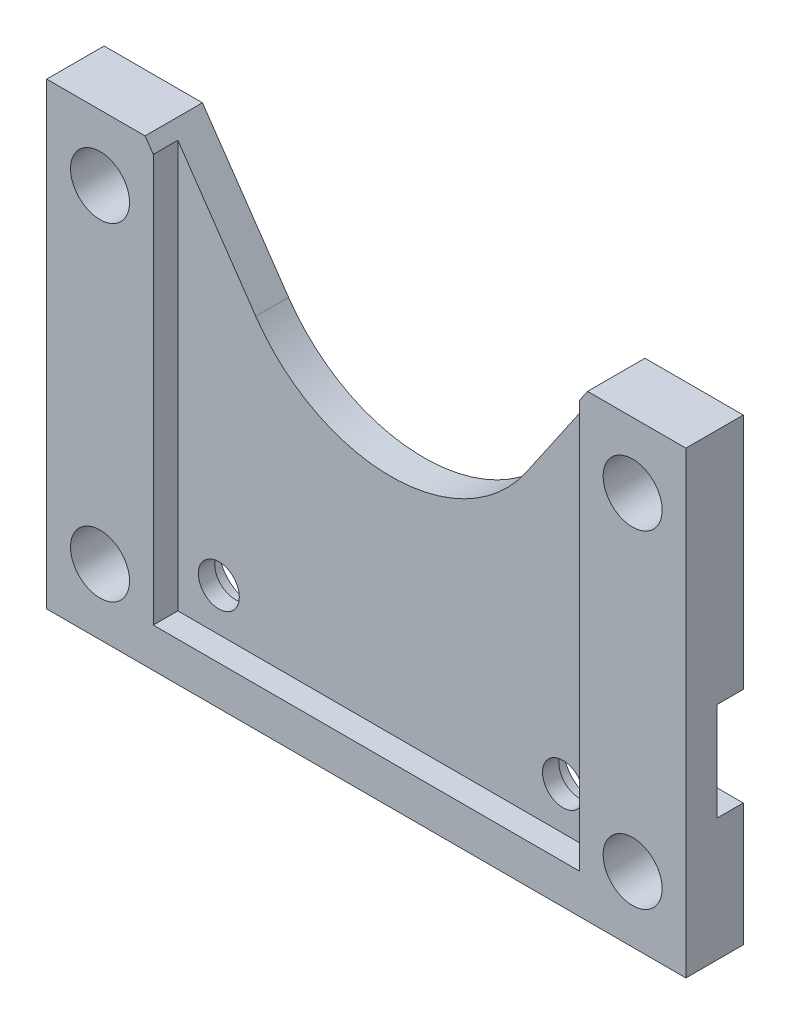
ISO-10303-21;
HEADER;
FILE_DESCRIPTION(('STEP AP214'),'2;1');
FILE_NAME('part.step','',(''),(''),'','','');
FILE_SCHEMA(('AUTOMOTIVE_DESIGN { 1 0 10303 214 1 1 1 1 }'));
ENDSEC;
DATA;
#1=APPLICATION_CONTEXT('core data for automotive mechanical design processes');
#2=APPLICATION_PROTOCOL_DEFINITION('international standard','automotive_design',2000,#1);
#3=PRODUCT_CONTEXT('',#1,'mechanical');
#4=PRODUCT('Part','Part','',(#3));
#5=PRODUCT_RELATED_PRODUCT_CATEGORY('part','',(#4));
#6=PRODUCT_DEFINITION_FORMATION('','',#4);
#7=PRODUCT_DEFINITION_CONTEXT('part definition',#1,'design');
#8=PRODUCT_DEFINITION('design','',#6,#7);
#9=PRODUCT_DEFINITION_SHAPE('','',#8);
#10=(LENGTH_UNIT() NAMED_UNIT(*) SI_UNIT(.MILLI.,.METRE.));
#11=(NAMED_UNIT(*) PLANE_ANGLE_UNIT() SI_UNIT($,.RADIAN.));
#12=(NAMED_UNIT(*) SI_UNIT($,.STERADIAN.) SOLID_ANGLE_UNIT());
#13=UNCERTAINTY_MEASURE_WITH_UNIT(LENGTH_MEASURE(1.E-05),#10,'distance_accuracy_value','');
#14=(GEOMETRIC_REPRESENTATION_CONTEXT(3) GLOBAL_UNCERTAINTY_ASSIGNED_CONTEXT((#13)) GLOBAL_UNIT_ASSIGNED_CONTEXT((#10,
#11,#12)) REPRESENTATION_CONTEXT('',''));
#15=CARTESIAN_POINT('',(0.,0.,0.));
#16=DIRECTION('',(0.,0.,1.));
#17=DIRECTION('',(1.,0.,0.));
#18=AXIS2_PLACEMENT_3D('',#15,#16,#17);
#19=CARTESIAN_POINT('',(0.,21.,0.));
#20=DIRECTION('',(0.,0.,1.));
#21=DIRECTION('',(1.,0.,0.));
#22=AXIS2_PLACEMENT_3D('',#19,#20,#21);
#23=PLANE('',#22);
#24=CARTESIAN_POINT('',(16.25,19.,0.));
#25=DIRECTION('',(0.,0.,1.));
#26=DIRECTION('',(-1.,0.,0.));
#27=AXIS2_PLACEMENT_3D('',#24,#25,#26);
#28=CIRCLE('',#27,1.8);
#29=CARTESIAN_POINT('',(14.45,19.,0.));
#30=VERTEX_POINT('',#29);
#31=EDGE_CURVE('E293',#30,#30,#28,.T.);
#32=ORIENTED_EDGE('',*,*,#31,.T.);
#33=EDGE_LOOP('',(#32));
#34=FACE_BOUND('',#33,.T.);
#35=CARTESIAN_POINT('',(-16.25,19.,0.));
#36=DIRECTION('',(0.,0.,1.));
#37=DIRECTION('',(1.,0.,0.));
#38=AXIS2_PLACEMENT_3D('',#35,#36,#37);
#39=CIRCLE('',#38,1.8);
#40=CARTESIAN_POINT('',(-14.45,19.,0.));
#41=VERTEX_POINT('',#40);
#42=EDGE_CURVE('E302',#41,#41,#39,.T.);
#43=ORIENTED_EDGE('',*,*,#42,.T.);
#44=EDGE_LOOP('',(#43));
#45=FACE_BOUND('',#44,.T.);
#46=DIRECTION('',(0.,1.,0.));
#47=VECTOR('',#46,1.);
#48=CARTESIAN_POINT('',(19.5,-5.,0.));
#49=LINE('',#48,#47);
#50=CARTESIAN_POINT('',(19.5,8.5,0.));
#51=VERTEX_POINT('',#50);
#52=CARTESIAN_POINT('',(19.5,23.,0.));
#53=VERTEX_POINT('',#52);
#54=EDGE_CURVE('E180',#51,#53,#49,.T.);
#55=ORIENTED_EDGE('',*,*,#54,.F.);
#56=DIRECTION('',(-1.,0.,0.));
#57=VECTOR('',#56,1.);
#58=CARTESIAN_POINT('',(19.5,8.5,0.));
#59=LINE('',#58,#57);
#60=CARTESIAN_POINT('',(-19.5,8.5,0.));
#61=VERTEX_POINT('',#60);
#62=EDGE_CURVE('E237',#51,#61,#59,.T.);
#63=ORIENTED_EDGE('',*,*,#62,.T.);
#64=DIRECTION('',(0.,-1.,0.));
#65=VECTOR('',#64,1.);
#66=CARTESIAN_POINT('',(-19.5,-5.,0.));
#67=LINE('',#66,#65);
#68=CARTESIAN_POINT('',(-19.5,23.,0.));
#69=VERTEX_POINT('',#68);
#70=EDGE_CURVE('E314',#69,#61,#67,.T.);
#71=ORIENTED_EDGE('',*,*,#70,.F.);
#72=DIRECTION('',(-1.,0.,0.));
#73=VECTOR('',#72,1.);
#74=CARTESIAN_POINT('',(-19.5,23.,0.));
#75=LINE('',#74,#73);
#76=CARTESIAN_POINT('',(-13.5,23.,0.));
#77=VERTEX_POINT('',#76);
#78=EDGE_CURVE('E193',#77,#69,#75,.T.);
#79=ORIENTED_EDGE('',*,*,#78,.F.);
#80=DIRECTION('',(-0.565775492304941,0.824559332193324,0.));
#81=VECTOR('',#80,1.);
#82=CARTESIAN_POINT('',(-13.5,23.,0.));
#83=LINE('',#82,#81);
#84=CARTESIAN_POINT('',(-8.24559332193325,15.3422450769506,0.));
#85=VERTEX_POINT('',#84);
#86=EDGE_CURVE('E191',#85,#77,#83,.T.);
#87=ORIENTED_EDGE('',*,*,#86,.F.);
#88=CARTESIAN_POINT('',(0.,21.,0.));
#89=DIRECTION('',(0.,0.,-1.));
#90=DIRECTION('',(1.,0.,0.));
#91=AXIS2_PLACEMENT_3D('',#88,#89,#90);
#92=CIRCLE('',#91,9.99999999999999);
#93=CARTESIAN_POINT('',(8.24559332193324,15.3422450769506,0.));
#94=VERTEX_POINT('',#93);
#95=EDGE_CURVE('E189',#94,#85,#92,.T.);
#96=ORIENTED_EDGE('',*,*,#95,.F.);
#97=DIRECTION('',(-0.565775492304941,-0.824559332193324,0.));
#98=VECTOR('',#97,1.);
#99=CARTESIAN_POINT('',(13.5,23.,0.));
#100=LINE('',#99,#98);
#101=CARTESIAN_POINT('',(13.5,23.,0.));
#102=VERTEX_POINT('',#101);
#103=EDGE_CURVE('E182',#102,#94,#100,.T.);
#104=ORIENTED_EDGE('',*,*,#103,.F.);
#105=DIRECTION('',(-1.,0.,0.));
#106=VECTOR('',#105,1.);
#107=CARTESIAN_POINT('',(19.5,23.,0.));
#108=LINE('',#107,#106);
#109=EDGE_CURVE('E179',#53,#102,#108,.T.);
#110=ORIENTED_EDGE('',*,*,#109,.F.);
#111=EDGE_LOOP('',(#55,#63,#71,#79,#87,#96,#104,#110));
#112=FACE_BOUND('',#111,.T.);
#113=ADVANCED_FACE('F41',(#34,#45,#112),#23,.F.);
#114=CARTESIAN_POINT('',(-10.5,0.,2.));
#115=DIRECTION('',(0.,0.,-1.));
#116=DIRECTION('',(-1.,0.,0.));
#117=AXIS2_PLACEMENT_3D('',#114,#115,#116);
#118=CYLINDRICAL_SURFACE('',#117,1.25);
#119=CARTESIAN_POINT('',(-10.5,0.,2.));
#120=DIRECTION('',(0.,0.,1.));
#121=DIRECTION('',(1.,0.,0.));
#122=AXIS2_PLACEMENT_3D('',#119,#120,#121);
#123=CIRCLE('',#122,1.25);
#124=CARTESIAN_POINT('',(-9.25,0.,2.));
#125=VERTEX_POINT('',#124);
#126=EDGE_CURVE('E308',#125,#125,#123,.T.);
#127=ORIENTED_EDGE('',*,*,#126,.T.);
#128=EDGE_LOOP('',(#127));
#129=FACE_BOUND('',#128,.T.);
#130=CARTESIAN_POINT('',(-10.5,0.,1.));
#131=DIRECTION('',(0.,0.,-1.));
#132=DIRECTION('',(-1.,0.,0.));
#133=AXIS2_PLACEMENT_3D('',#130,#131,#132);
#134=CIRCLE('',#133,1.25);
#135=CARTESIAN_POINT('',(-11.75,0.,1.));
#136=VERTEX_POINT('',#135);
#137=EDGE_CURVE('E45',#136,#136,#134,.T.);
#138=ORIENTED_EDGE('',*,*,#137,.T.);
#139=EDGE_LOOP('',(#138));
#140=FACE_BOUND('',#139,.T.);
#141=ADVANCED_FACE('F397',(#129,#140),#118,.F.);
#142=CARTESIAN_POINT('',(10.5,0.,2.));
#143=DIRECTION('',(0.,0.,-1.));
#144=DIRECTION('',(-1.,0.,0.));
#145=AXIS2_PLACEMENT_3D('',#142,#143,#144);
#146=CYLINDRICAL_SURFACE('',#145,1.25);
#147=CARTESIAN_POINT('',(10.5,0.,2.));
#148=DIRECTION('',(0.,0.,1.));
#149=DIRECTION('',(1.,0.,0.));
#150=AXIS2_PLACEMENT_3D('',#147,#148,#149);
#151=CIRCLE('',#150,1.25);
#152=CARTESIAN_POINT('',(11.75,0.,2.));
#153=VERTEX_POINT('',#152);
#154=EDGE_CURVE('E305',#153,#153,#151,.T.);
#155=ORIENTED_EDGE('',*,*,#154,.T.);
#156=EDGE_LOOP('',(#155));
#157=FACE_BOUND('',#156,.T.);
#158=CARTESIAN_POINT('',(10.5,0.,1.));
#159=DIRECTION('',(0.,0.,-1.));
#160=DIRECTION('',(-1.,0.,0.));
#161=AXIS2_PLACEMENT_3D('',#158,#159,#160);
#162=CIRCLE('',#161,1.25);
#163=CARTESIAN_POINT('',(9.25,0.,1.));
#164=VERTEX_POINT('',#163);
#165=EDGE_CURVE('E215',#164,#164,#162,.T.);
#166=ORIENTED_EDGE('',*,*,#165,.T.);
#167=EDGE_LOOP('',(#166));
#168=FACE_BOUND('',#167,.T.);
#169=ADVANCED_FACE('F404',(#157,#168),#146,.F.);
#170=CARTESIAN_POINT('',(0.,21.,2.));
#171=DIRECTION('',(0.,0.,1.));
#172=DIRECTION('',(1.,0.,0.));
#173=AXIS2_PLACEMENT_3D('',#170,#171,#172);
#174=PLANE('',#173);
#175=DIRECTION('',(0.,1.,0.));
#176=VECTOR('',#175,1.);
#177=CARTESIAN_POINT('',(-13.,22.2713016528569,2.));
#178=LINE('',#177,#176);
#179=CARTESIAN_POINT('',(-13.,-2.6,2.));
#180=VERTEX_POINT('',#179);
#181=CARTESIAN_POINT('',(-13.,22.2713016528569,2.));
#182=VERTEX_POINT('',#181);
#183=EDGE_CURVE('E66',#180,#182,#178,.T.);
#184=ORIENTED_EDGE('',*,*,#183,.F.);
#185=DIRECTION('',(-1.,0.,0.));
#186=VECTOR('',#185,1.);
#187=CARTESIAN_POINT('',(-13.,-2.6,2.));
#188=LINE('',#187,#186);
#189=CARTESIAN_POINT('',(13.,-2.6,2.));
#190=VERTEX_POINT('',#189);
#191=EDGE_CURVE('E279',#190,#180,#188,.T.);
#192=ORIENTED_EDGE('',*,*,#191,.F.);
#193=DIRECTION('',(0.,-1.,0.));
#194=VECTOR('',#193,1.);
#195=CARTESIAN_POINT('',(13.,22.2713016528569,2.));
#196=LINE('',#195,#194);
#197=CARTESIAN_POINT('',(13.,22.2713016528569,2.));
#198=VERTEX_POINT('',#197);
#199=EDGE_CURVE('E249',#198,#190,#196,.T.);
#200=ORIENTED_EDGE('',*,*,#199,.F.);
#201=DIRECTION('',(-0.565775492304941,-0.824559332193324,0.));
#202=VECTOR('',#201,1.);
#203=CARTESIAN_POINT('',(13.5,23.,2.));
#204=LINE('',#203,#202);
#205=CARTESIAN_POINT('',(8.24559332193324,15.3422450769506,2.));
#206=VERTEX_POINT('',#205);
#207=EDGE_CURVE('E195',#198,#206,#204,.T.);
#208=ORIENTED_EDGE('',*,*,#207,.T.);
#209=CARTESIAN_POINT('',(0.,21.,2.));
#210=DIRECTION('',(0.,0.,-1.));
#211=DIRECTION('',(1.,0.,0.));
#212=AXIS2_PLACEMENT_3D('',#209,#210,#211);
#213=CIRCLE('',#212,9.99999999999999);
#214=CARTESIAN_POINT('',(-8.24559332193325,15.3422450769506,2.));
#215=VERTEX_POINT('',#214);
#216=EDGE_CURVE('E312',#206,#215,#213,.T.);
#217=ORIENTED_EDGE('',*,*,#216,.T.);
#218=DIRECTION('',(-0.565775492304941,0.824559332193324,0.));
#219=VECTOR('',#218,1.);
#220=CARTESIAN_POINT('',(-13.5,23.,2.));
#221=LINE('',#220,#219);
#222=EDGE_CURVE('E200',#215,#182,#221,.T.);
#223=ORIENTED_EDGE('',*,*,#222,.T.);
#224=EDGE_LOOP('',(#184,#192,#200,#208,#217,#223));
#225=FACE_BOUND('',#224,.T.);
#226=ORIENTED_EDGE('',*,*,#126,.F.);
#227=EDGE_LOOP('',(#226));
#228=FACE_BOUND('',#227,.T.);
#229=ORIENTED_EDGE('',*,*,#154,.F.);
#230=EDGE_LOOP('',(#229));
#231=FACE_BOUND('',#230,.T.);
#232=ADVANCED_FACE('F349',(#225,#228,#231),#174,.T.);
#233=CARTESIAN_POINT('',(10.5,0.,0.));
#234=DIRECTION('',(0.,0.,-1.));
#235=DIRECTION('',(-1.,0.,0.));
#236=AXIS2_PLACEMENT_3D('',#233,#234,#235);
#237=CIRCLE('',#236,2.);
#238=CARTESIAN_POINT('',(8.5,0.,0.));
#239=VERTEX_POINT('',#238);
#240=EDGE_CURVE('E223',#239,#239,#237,.T.);
#241=ORIENTED_EDGE('',*,*,#240,.F.);
#242=EDGE_LOOP('',(#241));
#243=FACE_BOUND('',#242,.T.);
#244=CARTESIAN_POINT('',(-10.5,0.,0.));
#245=DIRECTION('',(0.,0.,-1.));
#246=DIRECTION('',(-1.,0.,0.));
#247=AXIS2_PLACEMENT_3D('',#244,#245,#246);
#248=CIRCLE('',#247,2.);
#249=CARTESIAN_POINT('',(-12.5,0.,0.));
#250=VERTEX_POINT('',#249);
#251=EDGE_CURVE('E228',#250,#250,#248,.T.);
#252=ORIENTED_EDGE('',*,*,#251,.F.);
#253=EDGE_LOOP('',(#252));
#254=FACE_BOUND('',#253,.T.);
#255=CARTESIAN_POINT('',(-19.5,2.5,0.));
#256=VERTEX_POINT('',#255);
#257=CARTESIAN_POINT('',(-19.5,-5.,0.));
#258=VERTEX_POINT('',#257);
#259=EDGE_CURVE('E173',#256,#258,#67,.T.);
#260=ORIENTED_EDGE('',*,*,#259,.F.);
#261=DIRECTION('',(-1.,0.,0.));
#262=VECTOR('',#261,1.);
#263=CARTESIAN_POINT('',(19.5,2.5,0.));
#264=LINE('',#263,#262);
#265=CARTESIAN_POINT('',(19.5,2.5,0.));
#266=VERTEX_POINT('',#265);
#267=EDGE_CURVE('E159',#266,#256,#264,.T.);
#268=ORIENTED_EDGE('',*,*,#267,.F.);
#269=CARTESIAN_POINT('',(19.5,-5.,0.));
#270=VERTEX_POINT('',#269);
#271=EDGE_CURVE('E172',#270,#266,#49,.T.);
#272=ORIENTED_EDGE('',*,*,#271,.F.);
#273=DIRECTION('',(1.,0.,0.));
#274=VECTOR('',#273,1.);
#275=CARTESIAN_POINT('',(19.5,-5.,0.));
#276=LINE('',#275,#274);
#277=EDGE_CURVE('E184',#258,#270,#276,.T.);
#278=ORIENTED_EDGE('',*,*,#277,.F.);
#279=EDGE_LOOP('',(#260,#268,#272,#278));
#280=FACE_BOUND('',#279,.T.);
#281=CARTESIAN_POINT('',(-16.25,-1.,0.));
#282=DIRECTION('',(0.,0.,1.));
#283=DIRECTION('',(1.,0.,0.));
#284=AXIS2_PLACEMENT_3D('',#281,#282,#283);
#285=CIRCLE('',#284,1.8);
#286=CARTESIAN_POINT('',(-14.45,-1.,0.));
#287=VERTEX_POINT('',#286);
#288=EDGE_CURVE('E299',#287,#287,#285,.T.);
#289=ORIENTED_EDGE('',*,*,#288,.T.);
#290=EDGE_LOOP('',(#289));
#291=FACE_BOUND('',#290,.T.);
#292=CARTESIAN_POINT('',(16.25,-1.,0.));
#293=DIRECTION('',(0.,0.,1.));
#294=DIRECTION('',(-1.,0.,0.));
#295=AXIS2_PLACEMENT_3D('',#292,#293,#294);
#296=CIRCLE('',#295,1.8);
#297=CARTESIAN_POINT('',(14.45,-1.,0.));
#298=VERTEX_POINT('',#297);
#299=EDGE_CURVE('E296',#298,#298,#296,.T.);
#300=ORIENTED_EDGE('',*,*,#299,.T.);
#301=EDGE_LOOP('',(#300));
#302=FACE_BOUND('',#301,.T.);
#303=ADVANCED_FACE('F169',(#243,#254,#280,#291,#302),#23,.F.);
#304=CARTESIAN_POINT('',(-19.5,-5.,2.));
#305=DIRECTION('',(1.,0.,0.));
#306=DIRECTION('',(0.,0.,-1.));
#307=AXIS2_PLACEMENT_3D('',#304,#305,#306);
#308=PLANE('',#307);
#309=ORIENTED_EDGE('',*,*,#70,.T.);
#310=DIRECTION('',(0.,0.,-1.));
#311=VECTOR('',#310,1.);
#312=CARTESIAN_POINT('',(-19.5,8.5,0.));
#313=LINE('',#312,#311);
#314=CARTESIAN_POINT('',(-19.5,8.5,1.6));
#315=VERTEX_POINT('',#314);
#316=EDGE_CURVE('E164',#315,#61,#313,.T.);
#317=ORIENTED_EDGE('',*,*,#316,.F.);
#318=DIRECTION('',(0.,1.,0.));
#319=VECTOR('',#318,1.);
#320=CARTESIAN_POINT('',(-19.5,8.5,1.6));
#321=LINE('',#320,#319);
#322=CARTESIAN_POINT('',(-19.5,2.5,1.6));
#323=VERTEX_POINT('',#322);
#324=EDGE_CURVE('E379',#323,#315,#321,.T.);
#325=ORIENTED_EDGE('',*,*,#324,.F.);
#326=DIRECTION('',(0.,0.,1.));
#327=VECTOR('',#326,1.);
#328=CARTESIAN_POINT('',(-19.5,2.5,0.));
#329=LINE('',#328,#327);
#330=EDGE_CURVE('E321',#256,#323,#329,.T.);
#331=ORIENTED_EDGE('',*,*,#330,.F.);
#332=ORIENTED_EDGE('',*,*,#259,.T.);
#333=DIRECTION('',(0.,0.,-1.));
#334=VECTOR('',#333,1.);
#335=CARTESIAN_POINT('',(-19.5,-5.,2.));
#336=LINE('',#335,#334);
#337=CARTESIAN_POINT('',(-19.5,-5.,3.5));
#338=VERTEX_POINT('',#337);
#339=EDGE_CURVE('E11',#338,#258,#336,.T.);
#340=ORIENTED_EDGE('',*,*,#339,.F.);
#341=DIRECTION('',(0.,-1.,0.));
#342=VECTOR('',#341,1.);
#343=CARTESIAN_POINT('',(-19.5,-5.,3.5));
#344=LINE('',#343,#342);
#345=CARTESIAN_POINT('',(-19.5,23.,3.5));
#346=VERTEX_POINT('',#345);
#347=EDGE_CURVE('E256',#346,#338,#344,.T.);
#348=ORIENTED_EDGE('',*,*,#347,.F.);
#349=DIRECTION('',(0.,0.,-1.));
#350=VECTOR('',#349,1.);
#351=CARTESIAN_POINT('',(-19.5,23.,2.));
#352=LINE('',#351,#350);
#353=EDGE_CURVE('E196',#346,#69,#352,.T.);
#354=ORIENTED_EDGE('',*,*,#353,.T.);
#355=EDGE_LOOP('',(#309,#317,#325,#331,#332,#340,#348,#354));
#356=FACE_BOUND('',#355,.T.);
#357=ADVANCED_FACE('F43',(#356),#308,.F.);
#358=CARTESIAN_POINT('',(19.5,-5.,2.));
#359=DIRECTION('',(0.,1.,0.));
#360=DIRECTION('',(-1.,0.,0.));
#361=AXIS2_PLACEMENT_3D('',#358,#359,#360);
#362=PLANE('',#361);
#363=ORIENTED_EDGE('',*,*,#277,.T.);
#364=DIRECTION('',(0.,0.,-1.));
#365=VECTOR('',#364,1.);
#366=CARTESIAN_POINT('',(19.5,-5.,2.));
#367=LINE('',#366,#365);
#368=CARTESIAN_POINT('',(19.5,-5.,3.5));
#369=VERTEX_POINT('',#368);
#370=EDGE_CURVE('E50',#369,#270,#367,.T.);
#371=ORIENTED_EDGE('',*,*,#370,.F.);
#372=DIRECTION('',(1.,0.,0.));
#373=VECTOR('',#372,1.);
#374=CARTESIAN_POINT('',(19.5,-5.,3.5));
#375=LINE('',#374,#373);
#376=EDGE_CURVE('E259',#338,#369,#375,.T.);
#377=ORIENTED_EDGE('',*,*,#376,.F.);
#378=ORIENTED_EDGE('',*,*,#339,.T.);
#379=EDGE_LOOP('',(#363,#371,#377,#378));
#380=FACE_BOUND('',#379,.T.);
#381=ADVANCED_FACE('F324',(#380),#362,.F.);
#382=CARTESIAN_POINT('',(19.5,-5.,2.));
#383=DIRECTION('',(-1.,0.,0.));
#384=DIRECTION('',(0.,-1.,0.));
#385=AXIS2_PLACEMENT_3D('',#382,#383,#384);
#386=PLANE('',#385);
#387=DIRECTION('',(0.,1.,0.));
#388=VECTOR('',#387,1.);
#389=CARTESIAN_POINT('',(19.5,8.5,1.6));
#390=LINE('',#389,#388);
#391=CARTESIAN_POINT('',(19.5,2.5,1.6));
#392=VERTEX_POINT('',#391);
#393=CARTESIAN_POINT('',(19.5,8.5,1.6));
#394=VERTEX_POINT('',#393);
#395=EDGE_CURVE('E58',#392,#394,#390,.T.);
#396=ORIENTED_EDGE('',*,*,#395,.T.);
#397=DIRECTION('',(0.,0.,-1.));
#398=VECTOR('',#397,1.);
#399=CARTESIAN_POINT('',(19.5,8.5,0.));
#400=LINE('',#399,#398);
#401=EDGE_CURVE('E174',#394,#51,#400,.T.);
#402=ORIENTED_EDGE('',*,*,#401,.T.);
#403=ORIENTED_EDGE('',*,*,#54,.T.);
#404=DIRECTION('',(0.,0.,-1.));
#405=VECTOR('',#404,1.);
#406=CARTESIAN_POINT('',(19.5,23.,2.));
#407=LINE('',#406,#405);
#408=CARTESIAN_POINT('',(19.5,23.,3.5));
#409=VERTEX_POINT('',#408);
#410=EDGE_CURVE('E212',#409,#53,#407,.T.);
#411=ORIENTED_EDGE('',*,*,#410,.F.);
#412=DIRECTION('',(0.,1.,0.));
#413=VECTOR('',#412,1.);
#414=CARTESIAN_POINT('',(19.5,-5.,3.5));
#415=LINE('',#414,#413);
#416=EDGE_CURVE('E262',#369,#409,#415,.T.);
#417=ORIENTED_EDGE('',*,*,#416,.F.);
#418=ORIENTED_EDGE('',*,*,#370,.T.);
#419=ORIENTED_EDGE('',*,*,#271,.T.);
#420=DIRECTION('',(0.,0.,1.));
#421=VECTOR('',#420,1.);
#422=CARTESIAN_POINT('',(19.5,2.5,0.));
#423=LINE('',#422,#421);
#424=EDGE_CURVE('E155',#266,#392,#423,.T.);
#425=ORIENTED_EDGE('',*,*,#424,.T.);
#426=EDGE_LOOP('',(#396,#402,#403,#411,#417,#418,#419,#425));
#427=FACE_BOUND('',#426,.T.);
#428=ADVANCED_FACE('F177',(#427),#386,.F.);
#429=CARTESIAN_POINT('',(19.5,23.,2.));
#430=DIRECTION('',(0.,-1.,0.));
#431=DIRECTION('',(1.,0.,0.));
#432=AXIS2_PLACEMENT_3D('',#429,#430,#431);
#433=PLANE('',#432);
#434=ORIENTED_EDGE('',*,*,#109,.T.);
#435=DIRECTION('',(0.,0.,-1.));
#436=VECTOR('',#435,1.);
#437=CARTESIAN_POINT('',(13.5,23.,2.));
#438=LINE('',#437,#436);
#439=CARTESIAN_POINT('',(13.5,23.,3.5));
#440=VERTEX_POINT('',#439);
#441=EDGE_CURVE('E209',#440,#102,#438,.T.);
#442=ORIENTED_EDGE('',*,*,#441,.F.);
#443=DIRECTION('',(-1.,0.,0.));
#444=VECTOR('',#443,1.);
#445=CARTESIAN_POINT('',(19.5,23.,3.5));
#446=LINE('',#445,#444);
#447=EDGE_CURVE('E265',#409,#440,#446,.T.);
#448=ORIENTED_EDGE('',*,*,#447,.F.);
#449=ORIENTED_EDGE('',*,*,#410,.T.);
#450=EDGE_LOOP('',(#434,#442,#448,#449));
#451=FACE_BOUND('',#450,.T.);
#452=ADVANCED_FACE('F333',(#451),#433,.F.);
#453=CARTESIAN_POINT('',(13.5,23.,2.));
#454=DIRECTION('',(0.824559332193324,-0.565775492304941,0.));
#455=DIRECTION('',(0.565775492304941,0.824559332193324,0.));
#456=AXIS2_PLACEMENT_3D('',#453,#454,#455);
#457=PLANE('',#456);
#458=ORIENTED_EDGE('',*,*,#103,.T.);
#459=DIRECTION('',(0.,0.,-1.));
#460=VECTOR('',#459,1.);
#461=CARTESIAN_POINT('',(8.24559332193324,15.3422450769506,2.));
#462=LINE('',#461,#460);
#463=EDGE_CURVE('E206',#206,#94,#462,.T.);
#464=ORIENTED_EDGE('',*,*,#463,.F.);
#465=ORIENTED_EDGE('',*,*,#207,.F.);
#466=DIRECTION('',(0.,0.,-1.));
#467=VECTOR('',#466,1.);
#468=CARTESIAN_POINT('',(13.,22.2713016528569,3.5));
#469=LINE('',#468,#467);
#470=CARTESIAN_POINT('',(13.,22.2713016528569,3.5));
#471=VERTEX_POINT('',#470);
#472=EDGE_CURVE('E290',#471,#198,#469,.T.);
#473=ORIENTED_EDGE('',*,*,#472,.F.);
#474=DIRECTION('',(-0.565775492304939,-0.824559332193326,0.));
#475=VECTOR('',#474,1.);
#476=CARTESIAN_POINT('',(13.5,23.,3.5));
#477=LINE('',#476,#475);
#478=EDGE_CURVE('E268',#440,#471,#477,.T.);
#479=ORIENTED_EDGE('',*,*,#478,.F.);
#480=ORIENTED_EDGE('',*,*,#441,.T.);
#481=EDGE_LOOP('',(#458,#464,#465,#473,#479,#480));
#482=FACE_BOUND('',#481,.T.);
#483=ADVANCED_FACE('F341',(#482),#457,.F.);
#484=CARTESIAN_POINT('',(0.,21.,2.));
#485=DIRECTION('',(0.,0.,-1.));
#486=DIRECTION('',(-1.,0.,0.));
#487=AXIS2_PLACEMENT_3D('',#484,#485,#486);
#488=CYLINDRICAL_SURFACE('',#487,9.99999999999999);
#489=ORIENTED_EDGE('',*,*,#95,.T.);
#490=DIRECTION('',(0.,0.,-1.));
#491=VECTOR('',#490,1.);
#492=CARTESIAN_POINT('',(-8.24559332193325,15.3422450769506,2.));
#493=LINE('',#492,#491);
#494=EDGE_CURVE('E203',#215,#85,#493,.T.);
#495=ORIENTED_EDGE('',*,*,#494,.F.);
#496=ORIENTED_EDGE('',*,*,#216,.F.);
#497=ORIENTED_EDGE('',*,*,#463,.T.);
#498=EDGE_LOOP('',(#489,#495,#496,#497));
#499=FACE_BOUND('',#498,.T.);
#500=ADVANCED_FACE('F346',(#499),#488,.F.);
#501=CARTESIAN_POINT('',(-13.5,23.,2.));
#502=DIRECTION('',(-0.824559332193324,-0.565775492304941,0.));
#503=DIRECTION('',(0.565775492304942,-0.824559332193325,0.));
#504=AXIS2_PLACEMENT_3D('',#501,#502,#503);
#505=PLANE('',#504);
#506=ORIENTED_EDGE('',*,*,#86,.T.);
#507=DIRECTION('',(0.,0.,-1.));
#508=VECTOR('',#507,1.);
#509=CARTESIAN_POINT('',(-13.5,23.,2.));
#510=LINE('',#509,#508);
#511=CARTESIAN_POINT('',(-13.5,23.,3.5));
#512=VERTEX_POINT('',#511);
#513=EDGE_CURVE('E199',#512,#77,#510,.T.);
#514=ORIENTED_EDGE('',*,*,#513,.F.);
#515=DIRECTION('',(-0.565775492304939,0.824559332193326,0.));
#516=VECTOR('',#515,1.);
#517=CARTESIAN_POINT('',(-13.5,23.,3.5));
#518=LINE('',#517,#516);
#519=CARTESIAN_POINT('',(-13.,22.2713016528569,3.5));
#520=VERTEX_POINT('',#519);
#521=EDGE_CURVE('E250',#520,#512,#518,.T.);
#522=ORIENTED_EDGE('',*,*,#521,.F.);
#523=DIRECTION('',(0.,0.,-1.));
#524=VECTOR('',#523,1.);
#525=CARTESIAN_POINT('',(-13.,22.2713016528569,3.5));
#526=LINE('',#525,#524);
#527=EDGE_CURVE('E276',#520,#182,#526,.T.);
#528=ORIENTED_EDGE('',*,*,#527,.T.);
#529=ORIENTED_EDGE('',*,*,#222,.F.);
#530=ORIENTED_EDGE('',*,*,#494,.T.);
#531=EDGE_LOOP('',(#506,#514,#522,#528,#529,#530));
#532=FACE_BOUND('',#531,.T.);
#533=ADVANCED_FACE('F366',(#532),#505,.F.);
#534=CARTESIAN_POINT('',(-19.5,23.,2.));
#535=DIRECTION('',(0.,-1.,0.));
#536=DIRECTION('',(1.,0.,0.));
#537=AXIS2_PLACEMENT_3D('',#534,#535,#536);
#538=PLANE('',#537);
#539=ORIENTED_EDGE('',*,*,#78,.T.);
#540=ORIENTED_EDGE('',*,*,#353,.F.);
#541=DIRECTION('',(-1.,0.,0.));
#542=VECTOR('',#541,1.);
#543=CARTESIAN_POINT('',(-19.5,23.,3.5));
#544=LINE('',#543,#542);
#545=EDGE_CURVE('E253',#512,#346,#544,.T.);
#546=ORIENTED_EDGE('',*,*,#545,.F.);
#547=ORIENTED_EDGE('',*,*,#513,.T.);
#548=EDGE_LOOP('',(#539,#540,#546,#547));
#549=FACE_BOUND('',#548,.T.);
#550=ADVANCED_FACE('F455',(#549),#538,.F.);
#551=CARTESIAN_POINT('',(-16.25,19.,2.));
#552=DIRECTION('',(0.,0.,-1.));
#553=DIRECTION('',(-1.,0.,0.));
#554=AXIS2_PLACEMENT_3D('',#551,#552,#553);
#555=CYLINDRICAL_SURFACE('',#554,1.8);
#556=ORIENTED_EDGE('',*,*,#42,.F.);
#557=EDGE_LOOP('',(#556));
#558=FACE_BOUND('',#557,.T.);
#559=CARTESIAN_POINT('',(-16.25,19.,3.5));
#560=DIRECTION('',(0.,0.,1.));
#561=DIRECTION('',(1.,0.,0.));
#562=AXIS2_PLACEMENT_3D('',#559,#560,#561);
#563=CIRCLE('',#562,1.8);
#564=CARTESIAN_POINT('',(-14.45,19.,3.5));
#565=VERTEX_POINT('',#564);
#566=EDGE_CURVE('E246',#565,#565,#563,.T.);
#567=ORIENTED_EDGE('',*,*,#566,.T.);
#568=EDGE_LOOP('',(#567));
#569=FACE_BOUND('',#568,.T.);
#570=ADVANCED_FACE('F451',(#558,#569),#555,.F.);
#571=CARTESIAN_POINT('',(-16.25,-1.,2.));
#572=DIRECTION('',(0.,0.,-1.));
#573=DIRECTION('',(-1.,0.,0.));
#574=AXIS2_PLACEMENT_3D('',#571,#572,#573);
#575=CYLINDRICAL_SURFACE('',#574,1.8);
#576=ORIENTED_EDGE('',*,*,#288,.F.);
#577=EDGE_LOOP('',(#576));
#578=FACE_BOUND('',#577,.T.);
#579=CARTESIAN_POINT('',(-16.25,-1.,3.5));
#580=DIRECTION('',(0.,0.,1.));
#581=DIRECTION('',(1.,0.,0.));
#582=AXIS2_PLACEMENT_3D('',#579,#580,#581);
#583=CIRCLE('',#582,1.8);
#584=CARTESIAN_POINT('',(-14.45,-1.,3.5));
#585=VERTEX_POINT('',#584);
#586=EDGE_CURVE('E243',#585,#585,#583,.T.);
#587=ORIENTED_EDGE('',*,*,#586,.T.);
#588=EDGE_LOOP('',(#587));
#589=FACE_BOUND('',#588,.T.);
#590=ADVANCED_FACE('F447',(#578,#589),#575,.F.);
#591=CARTESIAN_POINT('',(16.25,-1.,2.));
#592=DIRECTION('',(0.,0.,-1.));
#593=DIRECTION('',(-1.,0.,0.));
#594=AXIS2_PLACEMENT_3D('',#591,#592,#593);
#595=CYLINDRICAL_SURFACE('',#594,1.8);
#596=ORIENTED_EDGE('',*,*,#299,.F.);
#597=EDGE_LOOP('',(#596));
#598=FACE_BOUND('',#597,.T.);
#599=CARTESIAN_POINT('',(16.25,-1.,3.5));
#600=DIRECTION('',(0.,0.,1.));
#601=DIRECTION('',(-1.,0.,0.));
#602=AXIS2_PLACEMENT_3D('',#599,#600,#601);
#603=CIRCLE('',#602,1.8);
#604=CARTESIAN_POINT('',(14.45,-1.,3.5));
#605=VERTEX_POINT('',#604);
#606=EDGE_CURVE('E240',#605,#605,#603,.T.);
#607=ORIENTED_EDGE('',*,*,#606,.T.);
#608=EDGE_LOOP('',(#607));
#609=FACE_BOUND('',#608,.T.);
#610=ADVANCED_FACE('F443',(#598,#609),#595,.F.);
#611=CARTESIAN_POINT('',(16.25,19.,2.));
#612=DIRECTION('',(0.,0.,-1.));
#613=DIRECTION('',(-1.,0.,0.));
#614=AXIS2_PLACEMENT_3D('',#611,#612,#613);
#615=CYLINDRICAL_SURFACE('',#614,1.8);
#616=ORIENTED_EDGE('',*,*,#31,.F.);
#617=EDGE_LOOP('',(#616));
#618=FACE_BOUND('',#617,.T.);
#619=CARTESIAN_POINT('',(16.25,19.,3.5));
#620=DIRECTION('',(0.,0.,1.));
#621=DIRECTION('',(-1.,0.,0.));
#622=AXIS2_PLACEMENT_3D('',#619,#620,#621);
#623=CIRCLE('',#622,1.8);
#624=CARTESIAN_POINT('',(14.45,19.,3.5));
#625=VERTEX_POINT('',#624);
#626=EDGE_CURVE('E221',#625,#625,#623,.T.);
#627=ORIENTED_EDGE('',*,*,#626,.T.);
#628=EDGE_LOOP('',(#627));
#629=FACE_BOUND('',#628,.T.);
#630=ADVANCED_FACE('F434',(#618,#629),#615,.F.);
#631=CARTESIAN_POINT('',(0.,0.,3.5));
#632=DIRECTION('',(0.,0.,-1.));
#633=DIRECTION('',(-1.,0.,0.));
#634=AXIS2_PLACEMENT_3D('',#631,#632,#633);
#635=PLANE('',#634);
#636=ORIENTED_EDGE('',*,*,#521,.T.);
#637=ORIENTED_EDGE('',*,*,#545,.T.);
#638=ORIENTED_EDGE('',*,*,#347,.T.);
#639=ORIENTED_EDGE('',*,*,#376,.T.);
#640=ORIENTED_EDGE('',*,*,#416,.T.);
#641=ORIENTED_EDGE('',*,*,#447,.T.);
#642=ORIENTED_EDGE('',*,*,#478,.T.);
#643=DIRECTION('',(0.,-1.,0.));
#644=VECTOR('',#643,1.);
#645=CARTESIAN_POINT('',(13.,22.2713016528569,3.5));
#646=LINE('',#645,#644);
#647=CARTESIAN_POINT('',(13.,-2.6,3.5));
#648=VERTEX_POINT('',#647);
#649=EDGE_CURVE('E270',#471,#648,#646,.T.);
#650=ORIENTED_EDGE('',*,*,#649,.T.);
#651=DIRECTION('',(-1.,0.,0.));
#652=VECTOR('',#651,1.);
#653=CARTESIAN_POINT('',(-13.,-2.6,3.5));
#654=LINE('',#653,#652);
#655=CARTESIAN_POINT('',(-13.,-2.6,3.5));
#656=VERTEX_POINT('',#655);
#657=EDGE_CURVE('E272',#648,#656,#654,.T.);
#658=ORIENTED_EDGE('',*,*,#657,.T.);
#659=DIRECTION('',(0.,1.,0.));
#660=VECTOR('',#659,1.);
#661=CARTESIAN_POINT('',(-13.,22.2713016528569,3.5));
#662=LINE('',#661,#660);
#663=EDGE_CURVE('E274',#656,#520,#662,.T.);
#664=ORIENTED_EDGE('',*,*,#663,.T.);
#665=EDGE_LOOP('',(#636,#637,#638,#639,#640,#641,#642,#650,#658,#664));
#666=FACE_BOUND('',#665,.T.);
#667=ORIENTED_EDGE('',*,*,#566,.F.);
#668=EDGE_LOOP('',(#667));
#669=FACE_BOUND('',#668,.T.);
#670=ORIENTED_EDGE('',*,*,#586,.F.);
#671=EDGE_LOOP('',(#670));
#672=FACE_BOUND('',#671,.T.);
#673=ORIENTED_EDGE('',*,*,#606,.F.);
#674=EDGE_LOOP('',(#673));
#675=FACE_BOUND('',#674,.T.);
#676=ORIENTED_EDGE('',*,*,#626,.F.);
#677=EDGE_LOOP('',(#676));
#678=FACE_BOUND('',#677,.T.);
#679=ADVANCED_FACE('F326',(#666,#669,#672,#675,#678),#635,.F.);
#680=CARTESIAN_POINT('',(13.,22.2713016528569,3.5));
#681=DIRECTION('',(1.,0.,0.));
#682=DIRECTION('',(0.,0.,-1.));
#683=AXIS2_PLACEMENT_3D('',#680,#681,#682);
#684=PLANE('',#683);
#685=ORIENTED_EDGE('',*,*,#199,.T.);
#686=DIRECTION('',(0.,0.,-1.));
#687=VECTOR('',#686,1.);
#688=CARTESIAN_POINT('',(13.,-2.6,3.5));
#689=LINE('',#688,#687);
#690=EDGE_CURVE('E287',#648,#190,#689,.T.);
#691=ORIENTED_EDGE('',*,*,#690,.F.);
#692=ORIENTED_EDGE('',*,*,#649,.F.);
#693=ORIENTED_EDGE('',*,*,#472,.T.);
#694=EDGE_LOOP('',(#685,#691,#692,#693));
#695=FACE_BOUND('',#694,.T.);
#696=ADVANCED_FACE('F354',(#695),#684,.F.);
#697=CARTESIAN_POINT('',(-13.,-2.6,3.5));
#698=DIRECTION('',(0.,-1.,0.));
#699=DIRECTION('',(0.,0.,-1.));
#700=AXIS2_PLACEMENT_3D('',#697,#698,#699);
#701=PLANE('',#700);
#702=ORIENTED_EDGE('',*,*,#191,.T.);
#703=DIRECTION('',(0.,0.,-1.));
#704=VECTOR('',#703,1.);
#705=CARTESIAN_POINT('',(-13.,-2.6,3.5));
#706=LINE('',#705,#704);
#707=EDGE_CURVE('E284',#656,#180,#706,.T.);
#708=ORIENTED_EDGE('',*,*,#707,.F.);
#709=ORIENTED_EDGE('',*,*,#657,.F.);
#710=ORIENTED_EDGE('',*,*,#690,.T.);
#711=EDGE_LOOP('',(#702,#708,#709,#710));
#712=FACE_BOUND('',#711,.T.);
#713=ADVANCED_FACE('F361',(#712),#701,.F.);
#714=CARTESIAN_POINT('',(-13.,22.2713016528569,3.5));
#715=DIRECTION('',(-1.,0.,0.));
#716=DIRECTION('',(0.,0.,1.));
#717=AXIS2_PLACEMENT_3D('',#714,#715,#716);
#718=PLANE('',#717);
#719=ORIENTED_EDGE('',*,*,#183,.T.);
#720=ORIENTED_EDGE('',*,*,#527,.F.);
#721=ORIENTED_EDGE('',*,*,#663,.F.);
#722=ORIENTED_EDGE('',*,*,#707,.T.);
#723=EDGE_LOOP('',(#719,#720,#721,#722));
#724=FACE_BOUND('',#723,.T.);
#725=ADVANCED_FACE('F363',(#724),#718,.F.);
#726=CARTESIAN_POINT('',(10.5,0.,1.));
#727=DIRECTION('',(0.,0.,-1.));
#728=DIRECTION('',(-1.,0.,0.));
#729=AXIS2_PLACEMENT_3D('',#726,#727,#728);
#730=CYLINDRICAL_SURFACE('',#729,2.);
#731=CARTESIAN_POINT('',(10.5,0.,1.));
#732=DIRECTION('',(0.,0.,-1.));
#733=DIRECTION('',(-1.,0.,0.));
#734=AXIS2_PLACEMENT_3D('',#731,#732,#733);
#735=CIRCLE('',#734,2.);
#736=CARTESIAN_POINT('',(8.5,0.,1.));
#737=VERTEX_POINT('',#736);
#738=EDGE_CURVE('E217',#737,#737,#735,.T.);
#739=ORIENTED_EDGE('',*,*,#738,.F.);
#740=EDGE_LOOP('',(#739));
#741=FACE_BOUND('',#740,.T.);
#742=ORIENTED_EDGE('',*,*,#240,.T.);
#743=EDGE_LOOP('',(#742));
#744=FACE_BOUND('',#743,.T.);
#745=ADVANCED_FACE('F426',(#741,#744),#730,.F.);
#746=CARTESIAN_POINT('',(10.5,0.,1.));
#747=DIRECTION('',(0.,0.,-1.));
#748=DIRECTION('',(-1.,0.,0.));
#749=AXIS2_PLACEMENT_3D('',#746,#747,#748);
#750=PLANE('',#749);
#751=ORIENTED_EDGE('',*,*,#165,.F.);
#752=EDGE_LOOP('',(#751));
#753=FACE_BOUND('',#752,.T.);
#754=ORIENTED_EDGE('',*,*,#738,.T.);
#755=EDGE_LOOP('',(#754));
#756=FACE_BOUND('',#755,.T.);
#757=ADVANCED_FACE('F420',(#753,#756),#750,.T.);
#758=CARTESIAN_POINT('',(-10.5,0.,1.));
#759=DIRECTION('',(0.,0.,-1.));
#760=DIRECTION('',(-1.,0.,0.));
#761=AXIS2_PLACEMENT_3D('',#758,#759,#760);
#762=CYLINDRICAL_SURFACE('',#761,2.);
#763=CARTESIAN_POINT('',(-10.5,0.,1.));
#764=DIRECTION('',(0.,0.,-1.));
#765=DIRECTION('',(-1.,0.,0.));
#766=AXIS2_PLACEMENT_3D('',#763,#764,#765);
#767=CIRCLE('',#766,2.);
#768=CARTESIAN_POINT('',(-12.5,0.,1.));
#769=VERTEX_POINT('',#768);
#770=EDGE_CURVE('E234',#769,#769,#767,.T.);
#771=ORIENTED_EDGE('',*,*,#770,.F.);
#772=EDGE_LOOP('',(#771));
#773=FACE_BOUND('',#772,.T.);
#774=ORIENTED_EDGE('',*,*,#251,.T.);
#775=EDGE_LOOP('',(#774));
#776=FACE_BOUND('',#775,.T.);
#777=ADVANCED_FACE('F393',(#773,#776),#762,.F.);
#778=CARTESIAN_POINT('',(-10.5,0.,1.));
#779=DIRECTION('',(0.,0.,-1.));
#780=DIRECTION('',(-1.,0.,0.));
#781=AXIS2_PLACEMENT_3D('',#778,#779,#780);
#782=PLANE('',#781);
#783=ORIENTED_EDGE('',*,*,#137,.F.);
#784=EDGE_LOOP('',(#783));
#785=FACE_BOUND('',#784,.T.);
#786=ORIENTED_EDGE('',*,*,#770,.T.);
#787=EDGE_LOOP('',(#786));
#788=FACE_BOUND('',#787,.T.);
#789=ADVANCED_FACE('F385',(#785,#788),#782,.T.);
#790=CARTESIAN_POINT('',(19.5,8.5,0.));
#791=DIRECTION('',(0.,1.,0.));
#792=DIRECTION('',(0.,0.,1.));
#793=AXIS2_PLACEMENT_3D('',#790,#791,#792);
#794=PLANE('',#793);
#795=ORIENTED_EDGE('',*,*,#316,.T.);
#796=ORIENTED_EDGE('',*,*,#62,.F.);
#797=ORIENTED_EDGE('',*,*,#401,.F.);
#798=DIRECTION('',(-1.,0.,0.));
#799=VECTOR('',#798,1.);
#800=CARTESIAN_POINT('',(19.5,8.5,1.6));
#801=LINE('',#800,#799);
#802=EDGE_CURVE('E372',#394,#315,#801,.T.);
#803=ORIENTED_EDGE('',*,*,#802,.T.);
#804=EDGE_LOOP('',(#795,#796,#797,#803));
#805=FACE_BOUND('',#804,.T.);
#806=ADVANCED_FACE('F383',(#805),#794,.F.);
#807=CARTESIAN_POINT('',(19.5,8.5,1.6));
#808=DIRECTION('',(0.,0.,1.));
#809=DIRECTION('',(0.,-1.,0.));
#810=AXIS2_PLACEMENT_3D('',#807,#808,#809);
#811=PLANE('',#810);
#812=ORIENTED_EDGE('',*,*,#324,.T.);
#813=ORIENTED_EDGE('',*,*,#802,.F.);
#814=ORIENTED_EDGE('',*,*,#395,.F.);
#815=DIRECTION('',(-1.,0.,0.));
#816=VECTOR('',#815,1.);
#817=CARTESIAN_POINT('',(19.5,2.5,1.6));
#818=LINE('',#817,#816);
#819=EDGE_CURVE('E161',#392,#323,#818,.T.);
#820=ORIENTED_EDGE('',*,*,#819,.T.);
#821=EDGE_LOOP('',(#812,#813,#814,#820));
#822=FACE_BOUND('',#821,.T.);
#823=ADVANCED_FACE('F378',(#822),#811,.F.);
#824=CARTESIAN_POINT('',(19.5,2.5,0.));
#825=DIRECTION('',(0.,-1.,0.));
#826=DIRECTION('',(0.,0.,-1.));
#827=AXIS2_PLACEMENT_3D('',#824,#825,#826);
#828=PLANE('',#827);
#829=ORIENTED_EDGE('',*,*,#330,.T.);
#830=ORIENTED_EDGE('',*,*,#819,.F.);
#831=ORIENTED_EDGE('',*,*,#424,.F.);
#832=ORIENTED_EDGE('',*,*,#267,.T.);
#833=EDGE_LOOP('',(#829,#830,#831,#832));
#834=FACE_BOUND('',#833,.T.);
#835=ADVANCED_FACE('F158',(#834),#828,.F.);
#836=CLOSED_SHELL('',(#113,#141,#169,#232,#303,#357,#381,#428,#452,#483,#500,#533,#550,#570,
#590,#610,#630,#679,#696,#713,#725,#745,#757,#777,#789,#806,#823,#835));
#837=MANIFOLD_SOLID_BREP('B2',#836);
#838=ADVANCED_BREP_SHAPE_REPRESENTATION('',(#18,#837),#14);
#839=SHAPE_DEFINITION_REPRESENTATION(#9,#838);
ENDSEC;
END-ISO-10303-21;
